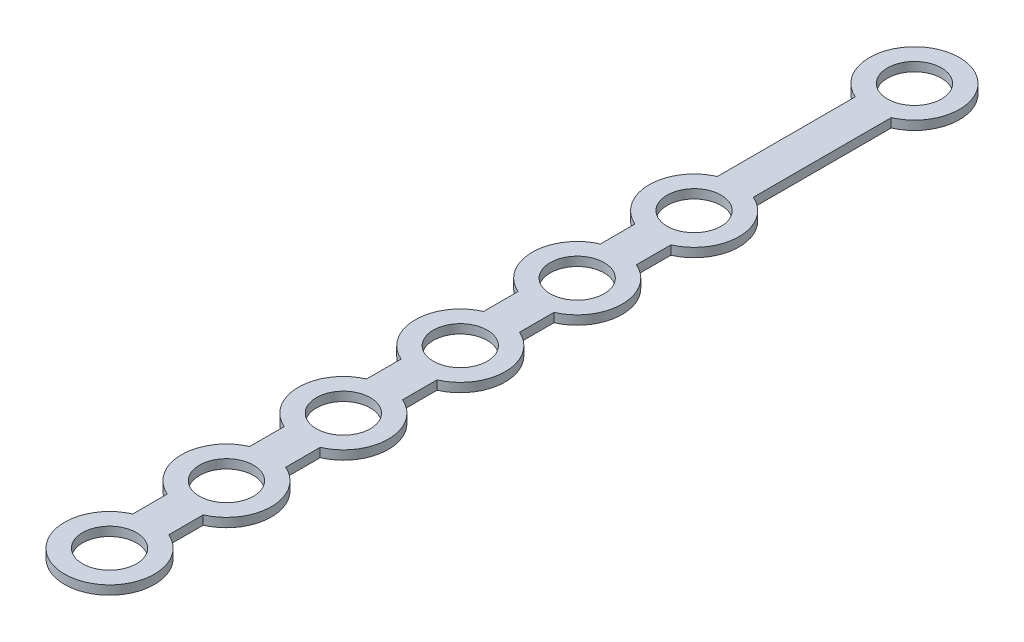
ISO-10303-21;
HEADER;
FILE_DESCRIPTION(('STEP AP214'),'2;1');
FILE_NAME('part.step','',(''),(''),'','','');
FILE_SCHEMA(('AUTOMOTIVE_DESIGN { 1 0 10303 214 1 1 1 1 }'));
ENDSEC;
DATA;
#1=APPLICATION_CONTEXT('core data for automotive mechanical design processes');
#2=APPLICATION_PROTOCOL_DEFINITION('international standard','automotive_design',2000,#1);
#3=PRODUCT_CONTEXT('',#1,'mechanical');
#4=PRODUCT('Part','Part','',(#3));
#5=PRODUCT_RELATED_PRODUCT_CATEGORY('part','',(#4));
#6=PRODUCT_DEFINITION_FORMATION('','',#4);
#7=PRODUCT_DEFINITION_CONTEXT('part definition',#1,'design');
#8=PRODUCT_DEFINITION('design','',#6,#7);
#9=PRODUCT_DEFINITION_SHAPE('','',#8);
#10=(LENGTH_UNIT() NAMED_UNIT(*) SI_UNIT(.MILLI.,.METRE.));
#11=(NAMED_UNIT(*) PLANE_ANGLE_UNIT() SI_UNIT($,.RADIAN.));
#12=(NAMED_UNIT(*) SI_UNIT($,.STERADIAN.) SOLID_ANGLE_UNIT());
#13=UNCERTAINTY_MEASURE_WITH_UNIT(LENGTH_MEASURE(1.E-05),#10,'distance_accuracy_value','');
#14=(GEOMETRIC_REPRESENTATION_CONTEXT(3) GLOBAL_UNCERTAINTY_ASSIGNED_CONTEXT((#13)) GLOBAL_UNIT_ASSIGNED_CONTEXT((#10,
#11,#12)) REPRESENTATION_CONTEXT('',''));
#15=CARTESIAN_POINT('',(0.,0.,0.));
#16=DIRECTION('',(0.,0.,1.));
#17=DIRECTION('',(1.,0.,0.));
#18=AXIS2_PLACEMENT_3D('',#15,#16,#17);
#19=CARTESIAN_POINT('',(0.,-2.,-130.));
#20=DIRECTION('',(0.,1.,0.));
#21=DIRECTION('',(0.,0.,1.));
#22=AXIS2_PLACEMENT_3D('',#19,#20,#21);
#23=CYLINDRICAL_SURFACE('',#22,10.);
#24=DIRECTION('',(0.,1.,0.));
#25=VECTOR('',#24,1.);
#26=CARTESIAN_POINT('',(4.,-2.,-139.165151389912));
#27=LINE('',#26,#25);
#28=CARTESIAN_POINT('',(4.,-2.,-139.165151389912));
#29=VERTEX_POINT('',#28);
#30=CARTESIAN_POINT('',(4.,0.,-139.165151389912));
#31=VERTEX_POINT('',#30);
#32=EDGE_CURVE('E239',#29,#31,#27,.T.);
#33=ORIENTED_EDGE('',*,*,#32,.T.);
#34=CARTESIAN_POINT('',(0.,0.,-130.));
#35=DIRECTION('',(0.,1.,0.));
#36=DIRECTION('',(0.,0.,1.));
#37=AXIS2_PLACEMENT_3D('',#34,#35,#36);
#38=CIRCLE('',#37,10.);
#39=CARTESIAN_POINT('',(3.99999999999999,0.,-120.834848610088));
#40=VERTEX_POINT('',#39);
#41=EDGE_CURVE('E232',#40,#31,#38,.T.);
#42=ORIENTED_EDGE('',*,*,#41,.F.);
#43=DIRECTION('',(0.,1.,0.));
#44=VECTOR('',#43,1.);
#45=CARTESIAN_POINT('',(3.99999999999999,-2.,-120.834848610088));
#46=LINE('',#45,#44);
#47=CARTESIAN_POINT('',(3.99999999999999,-2.,-120.834848610088));
#48=VERTEX_POINT('',#47);
#49=EDGE_CURVE('E60',#40,#48,#46,.F.);
#50=ORIENTED_EDGE('',*,*,#49,.T.);
#51=CARTESIAN_POINT('',(0.,-2.,-130.));
#52=DIRECTION('',(0.,1.,0.));
#53=DIRECTION('',(0.,0.,1.));
#54=AXIS2_PLACEMENT_3D('',#51,#52,#53);
#55=CIRCLE('',#54,10.);
#56=EDGE_CURVE('E244',#48,#29,#55,.T.);
#57=ORIENTED_EDGE('',*,*,#56,.T.);
#58=EDGE_LOOP('',(#33,#42,#50,#57));
#59=FACE_BOUND('',#58,.T.);
#60=ADVANCED_FACE('F52',(#59),#23,.T.);
#61=CARTESIAN_POINT('',(0.,-2.,-104.));
#62=DIRECTION('',(0.,1.,0.));
#63=DIRECTION('',(0.,0.,1.));
#64=AXIS2_PLACEMENT_3D('',#61,#62,#63);
#65=CYLINDRICAL_SURFACE('',#64,10.);
#66=DIRECTION('',(0.,1.,0.));
#67=VECTOR('',#66,1.);
#68=CARTESIAN_POINT('',(4.,-2.,-113.165151389912));
#69=LINE('',#68,#67);
#70=CARTESIAN_POINT('',(4.,-2.,-113.165151389912));
#71=VERTEX_POINT('',#70);
#72=CARTESIAN_POINT('',(4.,0.,-113.165151389912));
#73=VERTEX_POINT('',#72);
#74=EDGE_CURVE('E261',#71,#73,#69,.T.);
#75=ORIENTED_EDGE('',*,*,#74,.T.);
#76=CARTESIAN_POINT('',(0.,0.,-104.));
#77=DIRECTION('',(0.,1.,0.));
#78=DIRECTION('',(0.,0.,1.));
#79=AXIS2_PLACEMENT_3D('',#76,#77,#78);
#80=CIRCLE('',#79,10.);
#81=CARTESIAN_POINT('',(3.99999999999999,0.,-94.8348486100883));
#82=VERTEX_POINT('',#81);
#83=EDGE_CURVE('E271',#82,#73,#80,.T.);
#84=ORIENTED_EDGE('',*,*,#83,.F.);
#85=DIRECTION('',(0.,1.,0.));
#86=VECTOR('',#85,1.);
#87=CARTESIAN_POINT('',(3.99999999999999,-2.,-94.8348486100883));
#88=LINE('',#87,#86);
#89=CARTESIAN_POINT('',(3.99999999999999,-2.,-94.8348486100883));
#90=VERTEX_POINT('',#89);
#91=EDGE_CURVE('E398',#82,#90,#88,.F.);
#92=ORIENTED_EDGE('',*,*,#91,.T.);
#93=CARTESIAN_POINT('',(0.,-2.,-104.));
#94=DIRECTION('',(0.,1.,0.));
#95=DIRECTION('',(0.,0.,1.));
#96=AXIS2_PLACEMENT_3D('',#93,#94,#95);
#97=CIRCLE('',#96,10.);
#98=EDGE_CURVE('E266',#90,#71,#97,.T.);
#99=ORIENTED_EDGE('',*,*,#98,.T.);
#100=EDGE_LOOP('',(#75,#84,#92,#99));
#101=FACE_BOUND('',#100,.T.);
#102=ADVANCED_FACE('F411',(#101),#65,.T.);
#103=CARTESIAN_POINT('',(0.,-2.,-78.));
#104=DIRECTION('',(0.,1.,0.));
#105=DIRECTION('',(0.,0.,1.));
#106=AXIS2_PLACEMENT_3D('',#103,#104,#105);
#107=CYLINDRICAL_SURFACE('',#106,10.);
#108=DIRECTION('',(0.,1.,0.));
#109=VECTOR('',#108,1.);
#110=CARTESIAN_POINT('',(4.,-2.,-87.1651513899117));
#111=LINE('',#110,#109);
#112=CARTESIAN_POINT('',(4.,-2.,-87.1651513899117));
#113=VERTEX_POINT('',#112);
#114=CARTESIAN_POINT('',(4.,0.,-87.1651513899117));
#115=VERTEX_POINT('',#114);
#116=EDGE_CURVE('E287',#113,#115,#111,.T.);
#117=ORIENTED_EDGE('',*,*,#116,.T.);
#118=CARTESIAN_POINT('',(0.,0.,-78.));
#119=DIRECTION('',(0.,1.,0.));
#120=DIRECTION('',(0.,0.,1.));
#121=AXIS2_PLACEMENT_3D('',#118,#119,#120);
#122=CIRCLE('',#121,10.);
#123=CARTESIAN_POINT('',(3.99999999999999,0.,-68.8348486100883));
#124=VERTEX_POINT('',#123);
#125=EDGE_CURVE('E298',#124,#115,#122,.T.);
#126=ORIENTED_EDGE('',*,*,#125,.F.);
#127=DIRECTION('',(0.,1.,0.));
#128=VECTOR('',#127,1.);
#129=CARTESIAN_POINT('',(3.99999999999999,-2.,-68.8348486100883));
#130=LINE('',#129,#128);
#131=CARTESIAN_POINT('',(3.99999999999999,-2.,-68.8348486100883));
#132=VERTEX_POINT('',#131);
#133=EDGE_CURVE('E396',#124,#132,#130,.F.);
#134=ORIENTED_EDGE('',*,*,#133,.T.);
#135=CARTESIAN_POINT('',(0.,-2.,-78.));
#136=DIRECTION('',(0.,1.,0.));
#137=DIRECTION('',(0.,0.,1.));
#138=AXIS2_PLACEMENT_3D('',#135,#136,#137);
#139=CIRCLE('',#138,10.);
#140=EDGE_CURVE('E293',#132,#113,#139,.T.);
#141=ORIENTED_EDGE('',*,*,#140,.T.);
#142=EDGE_LOOP('',(#117,#126,#134,#141));
#143=FACE_BOUND('',#142,.T.);
#144=ADVANCED_FACE('F417',(#143),#107,.T.);
#145=CARTESIAN_POINT('',(0.,-2.,-52.));
#146=DIRECTION('',(0.,1.,0.));
#147=DIRECTION('',(0.,0.,1.));
#148=AXIS2_PLACEMENT_3D('',#145,#146,#147);
#149=CYLINDRICAL_SURFACE('',#148,10.);
#150=DIRECTION('',(0.,1.,0.));
#151=VECTOR('',#150,1.);
#152=CARTESIAN_POINT('',(-4.,-2.,-61.1651513899117));
#153=LINE('',#152,#151);
#154=CARTESIAN_POINT('',(-4.,-2.,-61.1651513899117));
#155=VERTEX_POINT('',#154);
#156=CARTESIAN_POINT('',(-4.,0.,-61.1651513899117));
#157=VERTEX_POINT('',#156);
#158=EDGE_CURVE('E314',#155,#157,#153,.T.);
#159=ORIENTED_EDGE('',*,*,#158,.F.);
#160=CARTESIAN_POINT('',(0.,-2.,-52.));
#161=DIRECTION('',(0.,1.,0.));
#162=DIRECTION('',(0.,0.,1.));
#163=AXIS2_PLACEMENT_3D('',#160,#161,#162);
#164=CIRCLE('',#163,10.);
#165=CARTESIAN_POINT('',(-4.,-2.,-42.8348486100883));
#166=VERTEX_POINT('',#165);
#167=EDGE_CURVE('E324',#155,#166,#164,.T.);
#168=ORIENTED_EDGE('',*,*,#167,.T.);
#169=DIRECTION('',(0.,1.,0.));
#170=VECTOR('',#169,1.);
#171=CARTESIAN_POINT('',(-4.,-2.,-42.8348486100883));
#172=LINE('',#171,#170);
#173=CARTESIAN_POINT('',(-4.,0.,-42.8348486100883));
#174=VERTEX_POINT('',#173);
#175=EDGE_CURVE('E391',#166,#174,#172,.T.);
#176=ORIENTED_EDGE('',*,*,#175,.T.);
#177=CARTESIAN_POINT('',(0.,0.,-52.));
#178=DIRECTION('',(0.,1.,0.));
#179=DIRECTION('',(0.,0.,1.));
#180=AXIS2_PLACEMENT_3D('',#177,#178,#179);
#181=CIRCLE('',#180,10.);
#182=EDGE_CURVE('E317',#157,#174,#181,.T.);
#183=ORIENTED_EDGE('',*,*,#182,.F.);
#184=EDGE_LOOP('',(#159,#168,#176,#183));
#185=FACE_BOUND('',#184,.T.);
#186=ADVANCED_FACE('F460',(#185),#149,.T.);
#187=CARTESIAN_POINT('',(0.,-2.,-26.));
#188=DIRECTION('',(0.,1.,0.));
#189=DIRECTION('',(0.,0.,1.));
#190=AXIS2_PLACEMENT_3D('',#187,#188,#189);
#191=CYLINDRICAL_SURFACE('',#190,10.);
#192=DIRECTION('',(0.,1.,0.));
#193=VECTOR('',#192,1.);
#194=CARTESIAN_POINT('',(4.,-2.,-35.1651513899117));
#195=LINE('',#194,#193);
#196=CARTESIAN_POINT('',(4.,-2.,-35.1651513899117));
#197=VERTEX_POINT('',#196);
#198=CARTESIAN_POINT('',(4.,0.,-35.1651513899117));
#199=VERTEX_POINT('',#198);
#200=EDGE_CURVE('E340',#197,#199,#195,.T.);
#201=ORIENTED_EDGE('',*,*,#200,.T.);
#202=CARTESIAN_POINT('',(0.,0.,-26.));
#203=DIRECTION('',(0.,1.,0.));
#204=DIRECTION('',(0.,0.,1.));
#205=AXIS2_PLACEMENT_3D('',#202,#203,#204);
#206=CIRCLE('',#205,10.);
#207=CARTESIAN_POINT('',(3.99999999999999,0.,-16.8348486100883));
#208=VERTEX_POINT('',#207);
#209=EDGE_CURVE('E357',#208,#199,#206,.T.);
#210=ORIENTED_EDGE('',*,*,#209,.F.);
#211=DIRECTION('',(0.,1.,0.));
#212=VECTOR('',#211,1.);
#213=CARTESIAN_POINT('',(4.,-2.,-16.8348486100883));
#214=LINE('',#213,#212);
#215=CARTESIAN_POINT('',(3.99999999999999,-2.,-16.8348486100883));
#216=VERTEX_POINT('',#215);
#217=EDGE_CURVE('E355',#216,#208,#214,.T.);
#218=ORIENTED_EDGE('',*,*,#217,.F.);
#219=CARTESIAN_POINT('',(0.,-2.,-26.));
#220=DIRECTION('',(0.,1.,0.));
#221=DIRECTION('',(0.,0.,1.));
#222=AXIS2_PLACEMENT_3D('',#219,#220,#221);
#223=CIRCLE('',#222,10.);
#224=EDGE_CURVE('E352',#216,#197,#223,.T.);
#225=ORIENTED_EDGE('',*,*,#224,.T.);
#226=EDGE_LOOP('',(#201,#210,#218,#225));
#227=FACE_BOUND('',#226,.T.);
#228=ADVANCED_FACE('F431',(#227),#191,.T.);
#229=CARTESIAN_POINT('',(0.,-2.,0.));
#230=DIRECTION('',(0.,1.,0.));
#231=DIRECTION('',(0.,0.,1.));
#232=AXIS2_PLACEMENT_3D('',#229,#230,#231);
#233=CYLINDRICAL_SURFACE('',#232,10.);
#234=DIRECTION('',(0.,1.,0.));
#235=VECTOR('',#234,1.);
#236=CARTESIAN_POINT('',(4.,-2.,-9.16515138991168));
#237=LINE('',#236,#235);
#238=CARTESIAN_POINT('',(4.,-2.,-9.16515138991168));
#239=VERTEX_POINT('',#238);
#240=CARTESIAN_POINT('',(4.,0.,-9.16515138991168));
#241=VERTEX_POINT('',#240);
#242=EDGE_CURVE('E376',#239,#241,#237,.T.);
#243=ORIENTED_EDGE('',*,*,#242,.T.);
#244=CARTESIAN_POINT('',(0.,0.,0.));
#245=DIRECTION('',(0.,1.,0.));
#246=DIRECTION('',(0.,0.,1.));
#247=AXIS2_PLACEMENT_3D('',#244,#245,#246);
#248=CIRCLE('',#247,10.);
#249=CARTESIAN_POINT('',(-4.,0.,-9.16515138991168));
#250=VERTEX_POINT('',#249);
#251=EDGE_CURVE('E385',#250,#241,#248,.T.);
#252=ORIENTED_EDGE('',*,*,#251,.F.);
#253=DIRECTION('',(0.,1.,0.));
#254=VECTOR('',#253,1.);
#255=CARTESIAN_POINT('',(-4.,-2.,-9.16515138991168));
#256=LINE('',#255,#254);
#257=CARTESIAN_POINT('',(-4.,-2.,-9.16515138991168));
#258=VERTEX_POINT('',#257);
#259=EDGE_CURVE('E372',#258,#250,#256,.T.);
#260=ORIENTED_EDGE('',*,*,#259,.F.);
#261=CARTESIAN_POINT('',(0.,-2.,0.));
#262=DIRECTION('',(0.,1.,0.));
#263=DIRECTION('',(0.,0.,1.));
#264=AXIS2_PLACEMENT_3D('',#261,#262,#263);
#265=CIRCLE('',#264,10.);
#266=EDGE_CURVE('E388',#258,#239,#265,.T.);
#267=ORIENTED_EDGE('',*,*,#266,.T.);
#268=EDGE_LOOP('',(#243,#252,#260,#267));
#269=FACE_BOUND('',#268,.T.);
#270=ADVANCED_FACE('F54',(#269),#233,.T.);
#271=CARTESIAN_POINT('',(0.,-2.,0.));
#272=DIRECTION('',(0.,1.,0.));
#273=DIRECTION('',(0.,0.,1.));
#274=AXIS2_PLACEMENT_3D('',#271,#272,#273);
#275=PLANE('',#274);
#276=CARTESIAN_POINT('',(0.,-2.,-52.));
#277=DIRECTION('',(0.,1.,0.));
#278=DIRECTION('',(0.,0.,1.));
#279=AXIS2_PLACEMENT_3D('',#276,#277,#278);
#280=CIRCLE('',#279,6.);
#281=CARTESIAN_POINT('',(0.,-2.,-46.));
#282=VERTEX_POINT('',#281);
#283=EDGE_CURVE('E218',#282,#282,#280,.T.);
#284=ORIENTED_EDGE('',*,*,#283,.T.);
#285=EDGE_LOOP('',(#284));
#286=FACE_BOUND('',#285,.T.);
#287=CARTESIAN_POINT('',(0.,-2.,-78.));
#288=DIRECTION('',(0.,1.,0.));
#289=DIRECTION('',(0.,0.,1.));
#290=AXIS2_PLACEMENT_3D('',#287,#288,#289);
#291=CIRCLE('',#290,6.);
#292=CARTESIAN_POINT('',(0.,-2.,-72.));
#293=VERTEX_POINT('',#292);
#294=EDGE_CURVE('E514',#293,#293,#291,.T.);
#295=ORIENTED_EDGE('',*,*,#294,.T.);
#296=EDGE_LOOP('',(#295));
#297=FACE_BOUND('',#296,.T.);
#298=CARTESIAN_POINT('',(0.,-2.,-104.));
#299=DIRECTION('',(0.,1.,0.));
#300=DIRECTION('',(0.,0.,1.));
#301=AXIS2_PLACEMENT_3D('',#298,#299,#300);
#302=CIRCLE('',#301,6.);
#303=CARTESIAN_POINT('',(0.,-2.,-98.));
#304=VERTEX_POINT('',#303);
#305=EDGE_CURVE('E508',#304,#304,#302,.T.);
#306=ORIENTED_EDGE('',*,*,#305,.T.);
#307=EDGE_LOOP('',(#306));
#308=FACE_BOUND('',#307,.T.);
#309=CARTESIAN_POINT('',(0.,-2.,-130.));
#310=DIRECTION('',(0.,1.,0.));
#311=DIRECTION('',(0.,0.,1.));
#312=AXIS2_PLACEMENT_3D('',#309,#310,#311);
#313=CIRCLE('',#312,6.);
#314=CARTESIAN_POINT('',(0.,-2.,-124.));
#315=VERTEX_POINT('',#314);
#316=EDGE_CURVE('E502',#315,#315,#313,.T.);
#317=ORIENTED_EDGE('',*,*,#316,.T.);
#318=EDGE_LOOP('',(#317));
#319=FACE_BOUND('',#318,.T.);
#320=CARTESIAN_POINT('',(0.,-2.,-179.));
#321=DIRECTION('',(0.,1.,0.));
#322=DIRECTION('',(0.,0.,1.));
#323=AXIS2_PLACEMENT_3D('',#320,#321,#322);
#324=CIRCLE('',#323,6.00000000000001);
#325=CARTESIAN_POINT('',(0.,-2.,-173.));
#326=VERTEX_POINT('',#325);
#327=EDGE_CURVE('E496',#326,#326,#324,.T.);
#328=ORIENTED_EDGE('',*,*,#327,.T.);
#329=EDGE_LOOP('',(#328));
#330=FACE_BOUND('',#329,.T.);
#331=CARTESIAN_POINT('',(0.,-2.,0.));
#332=DIRECTION('',(0.,1.,0.));
#333=DIRECTION('',(0.,0.,1.));
#334=AXIS2_PLACEMENT_3D('',#331,#332,#333);
#335=CIRCLE('',#334,6.);
#336=CARTESIAN_POINT('',(0.,-2.,6.));
#337=VERTEX_POINT('',#336);
#338=EDGE_CURVE('E382',#337,#337,#335,.T.);
#339=ORIENTED_EDGE('',*,*,#338,.T.);
#340=EDGE_LOOP('',(#339));
#341=FACE_BOUND('',#340,.T.);
#342=DIRECTION('',(0.,0.,1.));
#343=VECTOR('',#342,1.);
#344=CARTESIAN_POINT('',(-4.,-2.,-169.043915681042));
#345=LINE('',#344,#343);
#346=CARTESIAN_POINT('',(-4.,-2.,-169.834848610088));
#347=VERTEX_POINT('',#346);
#348=CARTESIAN_POINT('',(-4.,-2.,-139.165151389912));
#349=VERTEX_POINT('',#348);
#350=EDGE_CURVE('E234',#347,#349,#345,.T.);
#351=ORIENTED_EDGE('',*,*,#350,.F.);
#352=CARTESIAN_POINT('',(0.,-2.,-179.));
#353=DIRECTION('',(0.,1.,0.));
#354=DIRECTION('',(0.,0.,1.));
#355=AXIS2_PLACEMENT_3D('',#352,#353,#354);
#356=CIRCLE('',#355,10.);
#357=CARTESIAN_POINT('',(4.,-2.,-169.834848610088));
#358=VERTEX_POINT('',#357);
#359=EDGE_CURVE('E217',#358,#347,#356,.T.);
#360=ORIENTED_EDGE('',*,*,#359,.F.);
#361=DIRECTION('',(0.,0.,-1.));
#362=VECTOR('',#361,1.);
#363=CARTESIAN_POINT('',(4.,-2.,-160.165151389912));
#364=LINE('',#363,#362);
#365=EDGE_CURVE('E226',#29,#358,#364,.T.);
#366=ORIENTED_EDGE('',*,*,#365,.F.);
#367=ORIENTED_EDGE('',*,*,#56,.F.);
#368=DIRECTION('',(0.,0.,-1.));
#369=VECTOR('',#368,1.);
#370=CARTESIAN_POINT('',(4.,-2.,-113.165151389912));
#371=LINE('',#370,#369);
#372=EDGE_CURVE('E254',#71,#48,#371,.T.);
#373=ORIENTED_EDGE('',*,*,#372,.F.);
#374=ORIENTED_EDGE('',*,*,#98,.F.);
#375=DIRECTION('',(0.,0.,-1.));
#376=VECTOR('',#375,1.);
#377=CARTESIAN_POINT('',(4.,-2.,-87.1651513899117));
#378=LINE('',#377,#376);
#379=EDGE_CURVE('E279',#113,#90,#378,.T.);
#380=ORIENTED_EDGE('',*,*,#379,.F.);
#381=ORIENTED_EDGE('',*,*,#140,.F.);
#382=DIRECTION('',(0.,0.,-1.));
#383=VECTOR('',#382,1.);
#384=CARTESIAN_POINT('',(4.,-2.,-61.1651513899117));
#385=LINE('',#384,#383);
#386=CARTESIAN_POINT('',(4.,-2.,-61.1651513899117));
#387=VERTEX_POINT('',#386);
#388=EDGE_CURVE('E304',#387,#132,#385,.T.);
#389=ORIENTED_EDGE('',*,*,#388,.F.);
#390=CARTESIAN_POINT('',(3.99999999999999,-2.,-42.8348486100883));
#391=VERTEX_POINT('',#390);
#392=EDGE_CURVE('E320',#391,#387,#164,.T.);
#393=ORIENTED_EDGE('',*,*,#392,.F.);
#394=DIRECTION('',(0.,0.,-1.));
#395=VECTOR('',#394,1.);
#396=CARTESIAN_POINT('',(4.,-2.,-35.1651513899117));
#397=LINE('',#396,#395);
#398=EDGE_CURVE('E330',#197,#391,#397,.T.);
#399=ORIENTED_EDGE('',*,*,#398,.F.);
#400=ORIENTED_EDGE('',*,*,#224,.F.);
#401=DIRECTION('',(0.,0.,-1.));
#402=VECTOR('',#401,1.);
#403=CARTESIAN_POINT('',(4.,-2.,-13.));
#404=LINE('',#403,#402);
#405=EDGE_CURVE('E368',#239,#216,#404,.T.);
#406=ORIENTED_EDGE('',*,*,#405,.F.);
#407=ORIENTED_EDGE('',*,*,#266,.F.);
#408=DIRECTION('',(0.,0.,1.));
#409=VECTOR('',#408,1.);
#410=CARTESIAN_POINT('',(-4.,-2.,-13.));
#411=LINE('',#410,#409);
#412=CARTESIAN_POINT('',(-3.99999999999999,-2.,-16.8348486100883));
#413=VERTEX_POINT('',#412);
#414=EDGE_CURVE('E366',#413,#258,#411,.T.);
#415=ORIENTED_EDGE('',*,*,#414,.F.);
#416=CARTESIAN_POINT('',(-4.,-2.,-35.1651513899117));
#417=VERTEX_POINT('',#416);
#418=EDGE_CURVE('E356',#417,#413,#223,.T.);
#419=ORIENTED_EDGE('',*,*,#418,.F.);
#420=DIRECTION('',(0.,0.,1.));
#421=VECTOR('',#420,1.);
#422=CARTESIAN_POINT('',(-4.,-2.,-35.1651513899117));
#423=LINE('',#422,#421);
#424=EDGE_CURVE('E333',#166,#417,#423,.T.);
#425=ORIENTED_EDGE('',*,*,#424,.F.);
#426=ORIENTED_EDGE('',*,*,#167,.F.);
#427=DIRECTION('',(0.,0.,1.));
#428=VECTOR('',#427,1.);
#429=CARTESIAN_POINT('',(-4.,-2.,-61.1651513899117));
#430=LINE('',#429,#428);
#431=CARTESIAN_POINT('',(-4.,-2.,-68.8348486100883));
#432=VERTEX_POINT('',#431);
#433=EDGE_CURVE('E307',#432,#155,#430,.T.);
#434=ORIENTED_EDGE('',*,*,#433,.F.);
#435=CARTESIAN_POINT('',(-4.,-2.,-87.1651513899117));
#436=VERTEX_POINT('',#435);
#437=EDGE_CURVE('E297',#436,#432,#139,.T.);
#438=ORIENTED_EDGE('',*,*,#437,.F.);
#439=DIRECTION('',(0.,0.,1.));
#440=VECTOR('',#439,1.);
#441=CARTESIAN_POINT('',(-4.,-2.,-87.1651513899117));
#442=LINE('',#441,#440);
#443=CARTESIAN_POINT('',(-4.,-2.,-94.8348486100883));
#444=VERTEX_POINT('',#443);
#445=EDGE_CURVE('E277',#444,#436,#442,.T.);
#446=ORIENTED_EDGE('',*,*,#445,.F.);
#447=CARTESIAN_POINT('',(-4.,-2.,-113.165151389912));
#448=VERTEX_POINT('',#447);
#449=EDGE_CURVE('E270',#448,#444,#97,.T.);
#450=ORIENTED_EDGE('',*,*,#449,.F.);
#451=DIRECTION('',(0.,0.,1.));
#452=VECTOR('',#451,1.);
#453=CARTESIAN_POINT('',(-4.,-2.,-113.165151389912));
#454=LINE('',#453,#452);
#455=CARTESIAN_POINT('',(-4.,-2.,-120.834848610088));
#456=VERTEX_POINT('',#455);
#457=EDGE_CURVE('E252',#456,#448,#454,.T.);
#458=ORIENTED_EDGE('',*,*,#457,.F.);
#459=EDGE_CURVE('E248',#349,#456,#55,.T.);
#460=ORIENTED_EDGE('',*,*,#459,.F.);
#461=EDGE_LOOP('',(#351,#360,#366,#367,#373,#374,#380,#381,#389,#393,#399,#400,#406,#407,#415,
#419,#425,#426,#434,#438,#446,#450,#458,#460));
#462=FACE_BOUND('',#461,.T.);
#463=CARTESIAN_POINT('',(0.,-2.,-26.));
#464=DIRECTION('',(0.,1.,0.));
#465=DIRECTION('',(0.,0.,1.));
#466=AXIS2_PLACEMENT_3D('',#463,#464,#465);
#467=CIRCLE('',#466,6.);
#468=CARTESIAN_POINT('',(0.,-2.,-20.));
#469=VERTEX_POINT('',#468);
#470=EDGE_CURVE('E346',#469,#469,#467,.T.);
#471=ORIENTED_EDGE('',*,*,#470,.T.);
#472=EDGE_LOOP('',(#471));
#473=FACE_BOUND('',#472,.T.);
#474=ADVANCED_FACE('F406',(#286,#297,#308,#319,#330,#341,#462,#473),#275,.F.);
#475=CARTESIAN_POINT('',(0.,0.,0.));
#476=DIRECTION('',(0.,1.,0.));
#477=DIRECTION('',(0.,0.,1.));
#478=AXIS2_PLACEMENT_3D('',#475,#476,#477);
#479=PLANE('',#478);
#480=CARTESIAN_POINT('',(0.,0.,-52.));
#481=DIRECTION('',(0.,1.,0.));
#482=DIRECTION('',(0.,0.,1.));
#483=AXIS2_PLACEMENT_3D('',#480,#481,#482);
#484=CIRCLE('',#483,6.);
#485=CARTESIAN_POINT('',(0.,0.,-46.));
#486=VERTEX_POINT('',#485);
#487=EDGE_CURVE('E517',#486,#486,#484,.T.);
#488=ORIENTED_EDGE('',*,*,#487,.F.);
#489=EDGE_LOOP('',(#488));
#490=FACE_BOUND('',#489,.T.);
#491=CARTESIAN_POINT('',(0.,0.,-78.));
#492=DIRECTION('',(0.,1.,0.));
#493=DIRECTION('',(0.,0.,1.));
#494=AXIS2_PLACEMENT_3D('',#491,#492,#493);
#495=CIRCLE('',#494,6.);
#496=CARTESIAN_POINT('',(0.,0.,-72.));
#497=VERTEX_POINT('',#496);
#498=EDGE_CURVE('E511',#497,#497,#495,.T.);
#499=ORIENTED_EDGE('',*,*,#498,.F.);
#500=EDGE_LOOP('',(#499));
#501=FACE_BOUND('',#500,.T.);
#502=CARTESIAN_POINT('',(0.,0.,-104.));
#503=DIRECTION('',(0.,1.,0.));
#504=DIRECTION('',(0.,0.,1.));
#505=AXIS2_PLACEMENT_3D('',#502,#503,#504);
#506=CIRCLE('',#505,6.);
#507=CARTESIAN_POINT('',(0.,0.,-98.));
#508=VERTEX_POINT('',#507);
#509=EDGE_CURVE('E505',#508,#508,#506,.T.);
#510=ORIENTED_EDGE('',*,*,#509,.F.);
#511=EDGE_LOOP('',(#510));
#512=FACE_BOUND('',#511,.T.);
#513=CARTESIAN_POINT('',(0.,0.,-130.));
#514=DIRECTION('',(0.,1.,0.));
#515=DIRECTION('',(0.,0.,1.));
#516=AXIS2_PLACEMENT_3D('',#513,#514,#515);
#517=CIRCLE('',#516,6.);
#518=CARTESIAN_POINT('',(0.,0.,-124.));
#519=VERTEX_POINT('',#518);
#520=EDGE_CURVE('E499',#519,#519,#517,.T.);
#521=ORIENTED_EDGE('',*,*,#520,.F.);
#522=EDGE_LOOP('',(#521));
#523=FACE_BOUND('',#522,.T.);
#524=CARTESIAN_POINT('',(0.,0.,-179.));
#525=DIRECTION('',(0.,1.,0.));
#526=DIRECTION('',(0.,0.,1.));
#527=AXIS2_PLACEMENT_3D('',#524,#525,#526);
#528=CIRCLE('',#527,6.00000000000001);
#529=CARTESIAN_POINT('',(0.,0.,-173.));
#530=VERTEX_POINT('',#529);
#531=EDGE_CURVE('E493',#530,#530,#528,.T.);
#532=ORIENTED_EDGE('',*,*,#531,.F.);
#533=EDGE_LOOP('',(#532));
#534=FACE_BOUND('',#533,.T.);
#535=DIRECTION('',(0.,0.,-1.));
#536=VECTOR('',#535,1.);
#537=CARTESIAN_POINT('',(4.,0.,-160.165151389912));
#538=LINE('',#537,#536);
#539=CARTESIAN_POINT('',(4.,0.,-169.834848610088));
#540=VERTEX_POINT('',#539);
#541=EDGE_CURVE('E224',#31,#540,#538,.T.);
#542=ORIENTED_EDGE('',*,*,#541,.T.);
#543=CARTESIAN_POINT('',(0.,0.,-179.));
#544=DIRECTION('',(0.,1.,0.));
#545=DIRECTION('',(0.,0.,1.));
#546=AXIS2_PLACEMENT_3D('',#543,#544,#545);
#547=CIRCLE('',#546,10.);
#548=CARTESIAN_POINT('',(-4.,0.,-169.834848610088));
#549=VERTEX_POINT('',#548);
#550=EDGE_CURVE('E210',#540,#549,#547,.T.);
#551=ORIENTED_EDGE('',*,*,#550,.T.);
#552=DIRECTION('',(0.,0.,1.));
#553=VECTOR('',#552,1.);
#554=CARTESIAN_POINT('',(-4.,0.,-139.165151389912));
#555=LINE('',#554,#553);
#556=CARTESIAN_POINT('',(-3.99999999999998,0.,-139.165151389912));
#557=VERTEX_POINT('',#556);
#558=EDGE_CURVE('E67',#549,#557,#555,.T.);
#559=ORIENTED_EDGE('',*,*,#558,.T.);
#560=CARTESIAN_POINT('',(-4.,0.,-120.834848610088));
#561=VERTEX_POINT('',#560);
#562=EDGE_CURVE('E241',#557,#561,#38,.T.);
#563=ORIENTED_EDGE('',*,*,#562,.T.);
#564=DIRECTION('',(0.,0.,1.));
#565=VECTOR('',#564,1.);
#566=CARTESIAN_POINT('',(-4.,0.,-113.165151389912));
#567=LINE('',#566,#565);
#568=CARTESIAN_POINT('',(-3.99999999999996,0.,-113.165151389912));
#569=VERTEX_POINT('',#568);
#570=EDGE_CURVE('E73',#561,#569,#567,.T.);
#571=ORIENTED_EDGE('',*,*,#570,.T.);
#572=CARTESIAN_POINT('',(-4.,0.,-94.8348486100883));
#573=VERTEX_POINT('',#572);
#574=EDGE_CURVE('E264',#569,#573,#80,.T.);
#575=ORIENTED_EDGE('',*,*,#574,.T.);
#576=DIRECTION('',(0.,0.,1.));
#577=VECTOR('',#576,1.);
#578=CARTESIAN_POINT('',(-4.,0.,-87.1651513899117));
#579=LINE('',#578,#577);
#580=CARTESIAN_POINT('',(-3.99999999999999,0.,-87.1651513899117));
#581=VERTEX_POINT('',#580);
#582=EDGE_CURVE('E276',#573,#581,#579,.T.);
#583=ORIENTED_EDGE('',*,*,#582,.T.);
#584=CARTESIAN_POINT('',(-4.,0.,-68.8348486100883));
#585=VERTEX_POINT('',#584);
#586=EDGE_CURVE('E290',#581,#585,#122,.T.);
#587=ORIENTED_EDGE('',*,*,#586,.T.);
#588=DIRECTION('',(0.,0.,1.));
#589=VECTOR('',#588,1.);
#590=CARTESIAN_POINT('',(-4.,0.,-61.1651513899117));
#591=LINE('',#590,#589);
#592=EDGE_CURVE('E308',#585,#157,#591,.T.);
#593=ORIENTED_EDGE('',*,*,#592,.T.);
#594=ORIENTED_EDGE('',*,*,#182,.T.);
#595=DIRECTION('',(0.,0.,1.));
#596=VECTOR('',#595,1.);
#597=CARTESIAN_POINT('',(-4.,0.,-35.1651513899117));
#598=LINE('',#597,#596);
#599=CARTESIAN_POINT('',(-3.99999999999998,0.,-35.1651513899117));
#600=VERTEX_POINT('',#599);
#601=EDGE_CURVE('E334',#174,#600,#598,.T.);
#602=ORIENTED_EDGE('',*,*,#601,.T.);
#603=CARTESIAN_POINT('',(-4.,0.,-16.8348486100883));
#604=VERTEX_POINT('',#603);
#605=EDGE_CURVE('E349',#600,#604,#206,.T.);
#606=ORIENTED_EDGE('',*,*,#605,.T.);
#607=DIRECTION('',(0.,0.,1.));
#608=VECTOR('',#607,1.);
#609=CARTESIAN_POINT('',(-4.,0.,-13.));
#610=LINE('',#609,#608);
#611=EDGE_CURVE('E363',#604,#250,#610,.T.);
#612=ORIENTED_EDGE('',*,*,#611,.T.);
#613=ORIENTED_EDGE('',*,*,#251,.T.);
#614=DIRECTION('',(0.,0.,-1.));
#615=VECTOR('',#614,1.);
#616=CARTESIAN_POINT('',(4.,0.,-13.));
#617=LINE('',#616,#615);
#618=EDGE_CURVE('E369',#241,#208,#617,.T.);
#619=ORIENTED_EDGE('',*,*,#618,.T.);
#620=ORIENTED_EDGE('',*,*,#209,.T.);
#621=DIRECTION('',(0.,0.,-1.));
#622=VECTOR('',#621,1.);
#623=CARTESIAN_POINT('',(4.,0.,-35.1651513899117));
#624=LINE('',#623,#622);
#625=CARTESIAN_POINT('',(3.99999999999999,0.,-42.8348486100883));
#626=VERTEX_POINT('',#625);
#627=EDGE_CURVE('E329',#199,#626,#624,.T.);
#628=ORIENTED_EDGE('',*,*,#627,.T.);
#629=CARTESIAN_POINT('',(4.,0.,-61.1651513899117));
#630=VERTEX_POINT('',#629);
#631=EDGE_CURVE('E325',#626,#630,#181,.T.);
#632=ORIENTED_EDGE('',*,*,#631,.T.);
#633=DIRECTION('',(0.,0.,-1.));
#634=VECTOR('',#633,1.);
#635=CARTESIAN_POINT('',(4.,0.,-61.1651513899117));
#636=LINE('',#635,#634);
#637=EDGE_CURVE('E303',#630,#124,#636,.T.);
#638=ORIENTED_EDGE('',*,*,#637,.T.);
#639=ORIENTED_EDGE('',*,*,#125,.T.);
#640=DIRECTION('',(0.,0.,-1.));
#641=VECTOR('',#640,1.);
#642=CARTESIAN_POINT('',(4.,0.,-87.1651513899117));
#643=LINE('',#642,#641);
#644=EDGE_CURVE('E280',#115,#82,#643,.T.);
#645=ORIENTED_EDGE('',*,*,#644,.T.);
#646=ORIENTED_EDGE('',*,*,#83,.T.);
#647=DIRECTION('',(0.,0.,-1.));
#648=VECTOR('',#647,1.);
#649=CARTESIAN_POINT('',(4.,0.,-113.165151389912));
#650=LINE('',#649,#648);
#651=EDGE_CURVE('E255',#73,#40,#650,.T.);
#652=ORIENTED_EDGE('',*,*,#651,.T.);
#653=ORIENTED_EDGE('',*,*,#41,.T.);
#654=EDGE_LOOP('',(#542,#551,#559,#563,#571,#575,#583,#587,#593,#594,#602,#606,#612,#613,#619,
#620,#628,#632,#638,#639,#645,#646,#652,#653));
#655=FACE_BOUND('',#654,.T.);
#656=CARTESIAN_POINT('',(0.,0.,0.));
#657=DIRECTION('',(0.,1.,0.));
#658=DIRECTION('',(0.,0.,1.));
#659=AXIS2_PLACEMENT_3D('',#656,#657,#658);
#660=CIRCLE('',#659,6.);
#661=CARTESIAN_POINT('',(0.,0.,6.));
#662=VERTEX_POINT('',#661);
#663=EDGE_CURVE('E379',#662,#662,#660,.T.);
#664=ORIENTED_EDGE('',*,*,#663,.F.);
#665=EDGE_LOOP('',(#664));
#666=FACE_BOUND('',#665,.T.);
#667=CARTESIAN_POINT('',(0.,0.,-26.));
#668=DIRECTION('',(0.,1.,0.));
#669=DIRECTION('',(0.,0.,1.));
#670=AXIS2_PLACEMENT_3D('',#667,#668,#669);
#671=CIRCLE('',#670,6.);
#672=CARTESIAN_POINT('',(0.,0.,-20.));
#673=VERTEX_POINT('',#672);
#674=EDGE_CURVE('E343',#673,#673,#671,.T.);
#675=ORIENTED_EDGE('',*,*,#674,.F.);
#676=EDGE_LOOP('',(#675));
#677=FACE_BOUND('',#676,.T.);
#678=ADVANCED_FACE('F229',(#490,#501,#512,#523,#534,#655,#666,#677),#479,.T.);
#679=CARTESIAN_POINT('',(0.,-2.,0.));
#680=DIRECTION('',(0.,1.,0.));
#681=DIRECTION('',(0.,0.,1.));
#682=AXIS2_PLACEMENT_3D('',#679,#680,#681);
#683=CYLINDRICAL_SURFACE('',#682,6.);
#684=ORIENTED_EDGE('',*,*,#338,.F.);
#685=EDGE_LOOP('',(#684));
#686=FACE_BOUND('',#685,.T.);
#687=ORIENTED_EDGE('',*,*,#663,.T.);
#688=EDGE_LOOP('',(#687));
#689=FACE_BOUND('',#688,.T.);
#690=ADVANCED_FACE('F534',(#686,#689),#683,.F.);
#691=CARTESIAN_POINT('',(-4.,-2.,-13.));
#692=DIRECTION('',(-1.,0.,0.));
#693=DIRECTION('',(0.,0.,1.));
#694=AXIS2_PLACEMENT_3D('',#691,#692,#693);
#695=PLANE('',#694);
#696=ORIENTED_EDGE('',*,*,#611,.F.);
#697=DIRECTION('',(0.,1.,0.));
#698=VECTOR('',#697,1.);
#699=CARTESIAN_POINT('',(-4.,-2.,-16.8348486100883));
#700=LINE('',#699,#698);
#701=EDGE_CURVE('E360',#413,#604,#700,.T.);
#702=ORIENTED_EDGE('',*,*,#701,.F.);
#703=ORIENTED_EDGE('',*,*,#414,.T.);
#704=ORIENTED_EDGE('',*,*,#259,.T.);
#705=EDGE_LOOP('',(#696,#702,#703,#704));
#706=FACE_BOUND('',#705,.T.);
#707=ADVANCED_FACE('F444',(#706),#695,.T.);
#708=CARTESIAN_POINT('',(4.,-2.,-13.));
#709=DIRECTION('',(1.,0.,0.));
#710=DIRECTION('',(0.,0.,-1.));
#711=AXIS2_PLACEMENT_3D('',#708,#709,#710);
#712=PLANE('',#711);
#713=ORIENTED_EDGE('',*,*,#618,.F.);
#714=ORIENTED_EDGE('',*,*,#242,.F.);
#715=ORIENTED_EDGE('',*,*,#405,.T.);
#716=ORIENTED_EDGE('',*,*,#217,.T.);
#717=EDGE_LOOP('',(#713,#714,#715,#716));
#718=FACE_BOUND('',#717,.T.);
#719=ADVANCED_FACE('F436',(#718),#712,.T.);
#720=DIRECTION('',(0.,1.,0.));
#721=VECTOR('',#720,1.);
#722=CARTESIAN_POINT('',(-4.,-2.,-35.1651513899117));
#723=LINE('',#722,#721);
#724=EDGE_CURVE('E336',#417,#600,#723,.T.);
#725=ORIENTED_EDGE('',*,*,#724,.F.);
#726=ORIENTED_EDGE('',*,*,#418,.T.);
#727=ORIENTED_EDGE('',*,*,#701,.T.);
#728=ORIENTED_EDGE('',*,*,#605,.F.);
#729=EDGE_LOOP('',(#725,#726,#727,#728));
#730=FACE_BOUND('',#729,.T.);
#731=ADVANCED_FACE('F450',(#730),#191,.T.);
#732=CARTESIAN_POINT('',(0.,-2.,-26.));
#733=DIRECTION('',(0.,1.,0.));
#734=DIRECTION('',(0.,0.,1.));
#735=AXIS2_PLACEMENT_3D('',#732,#733,#734);
#736=CYLINDRICAL_SURFACE('',#735,6.);
#737=ORIENTED_EDGE('',*,*,#470,.F.);
#738=EDGE_LOOP('',(#737));
#739=FACE_BOUND('',#738,.T.);
#740=ORIENTED_EDGE('',*,*,#674,.T.);
#741=EDGE_LOOP('',(#740));
#742=FACE_BOUND('',#741,.T.);
#743=ADVANCED_FACE('F593',(#739,#742),#736,.F.);
#744=CARTESIAN_POINT('',(4.,-2.,-35.1651513899117));
#745=DIRECTION('',(1.,0.,0.));
#746=DIRECTION('',(0.,0.,-1.));
#747=AXIS2_PLACEMENT_3D('',#744,#745,#746);
#748=PLANE('',#747);
#749=DIRECTION('',(0.,1.,0.));
#750=VECTOR('',#749,1.);
#751=CARTESIAN_POINT('',(3.99999999999999,-2.,-42.8348486100883));
#752=LINE('',#751,#750);
#753=EDGE_CURVE('E323',#626,#391,#752,.F.);
#754=ORIENTED_EDGE('',*,*,#753,.F.);
#755=ORIENTED_EDGE('',*,*,#627,.F.);
#756=ORIENTED_EDGE('',*,*,#200,.F.);
#757=ORIENTED_EDGE('',*,*,#398,.T.);
#758=EDGE_LOOP('',(#754,#755,#756,#757));
#759=FACE_BOUND('',#758,.T.);
#760=ADVANCED_FACE('F428',(#759),#748,.T.);
#761=CARTESIAN_POINT('',(-4.,-2.,-35.1651513899117));
#762=DIRECTION('',(-1.,0.,0.));
#763=DIRECTION('',(0.,0.,1.));
#764=AXIS2_PLACEMENT_3D('',#761,#762,#763);
#765=PLANE('',#764);
#766=ORIENTED_EDGE('',*,*,#175,.F.);
#767=ORIENTED_EDGE('',*,*,#424,.T.);
#768=ORIENTED_EDGE('',*,*,#724,.T.);
#769=ORIENTED_EDGE('',*,*,#601,.F.);
#770=EDGE_LOOP('',(#766,#767,#768,#769));
#771=FACE_BOUND('',#770,.T.);
#772=ADVANCED_FACE('F454',(#771),#765,.T.);
#773=DIRECTION('',(0.,1.,0.));
#774=VECTOR('',#773,1.);
#775=CARTESIAN_POINT('',(4.,-2.,-61.1651513899117));
#776=LINE('',#775,#774);
#777=EDGE_CURVE('E310',#387,#630,#776,.T.);
#778=ORIENTED_EDGE('',*,*,#777,.T.);
#779=ORIENTED_EDGE('',*,*,#631,.F.);
#780=ORIENTED_EDGE('',*,*,#753,.T.);
#781=ORIENTED_EDGE('',*,*,#392,.T.);
#782=EDGE_LOOP('',(#778,#779,#780,#781));
#783=FACE_BOUND('',#782,.T.);
#784=ADVANCED_FACE('F425',(#783),#149,.T.);
#785=CARTESIAN_POINT('',(-4.,-2.,-61.1651513899117));
#786=DIRECTION('',(-1.,0.,0.));
#787=DIRECTION('',(0.,0.,1.));
#788=AXIS2_PLACEMENT_3D('',#785,#786,#787);
#789=PLANE('',#788);
#790=DIRECTION('',(0.,1.,0.));
#791=VECTOR('',#790,1.);
#792=CARTESIAN_POINT('',(-4.,-2.,-68.8348486100883));
#793=LINE('',#792,#791);
#794=EDGE_CURVE('E296',#432,#585,#793,.T.);
#795=ORIENTED_EDGE('',*,*,#794,.F.);
#796=ORIENTED_EDGE('',*,*,#433,.T.);
#797=ORIENTED_EDGE('',*,*,#158,.T.);
#798=ORIENTED_EDGE('',*,*,#592,.F.);
#799=EDGE_LOOP('',(#795,#796,#797,#798));
#800=FACE_BOUND('',#799,.T.);
#801=ADVANCED_FACE('F465',(#800),#789,.T.);
#802=CARTESIAN_POINT('',(4.,-2.,-61.1651513899117));
#803=DIRECTION('',(1.,0.,0.));
#804=DIRECTION('',(0.,0.,-1.));
#805=AXIS2_PLACEMENT_3D('',#802,#803,#804);
#806=PLANE('',#805);
#807=ORIENTED_EDGE('',*,*,#133,.F.);
#808=ORIENTED_EDGE('',*,*,#637,.F.);
#809=ORIENTED_EDGE('',*,*,#777,.F.);
#810=ORIENTED_EDGE('',*,*,#388,.T.);
#811=EDGE_LOOP('',(#807,#808,#809,#810));
#812=FACE_BOUND('',#811,.T.);
#813=ADVANCED_FACE('F423',(#812),#806,.T.);
#814=DIRECTION('',(0.,1.,0.));
#815=VECTOR('',#814,1.);
#816=CARTESIAN_POINT('',(-4.,-2.,-87.1651513899117));
#817=LINE('',#816,#815);
#818=EDGE_CURVE('E283',#436,#581,#817,.T.);
#819=ORIENTED_EDGE('',*,*,#818,.F.);
#820=ORIENTED_EDGE('',*,*,#437,.T.);
#821=ORIENTED_EDGE('',*,*,#794,.T.);
#822=ORIENTED_EDGE('',*,*,#586,.F.);
#823=EDGE_LOOP('',(#819,#820,#821,#822));
#824=FACE_BOUND('',#823,.T.);
#825=ADVANCED_FACE('F469',(#824),#107,.T.);
#826=CARTESIAN_POINT('',(-4.,-2.,-87.1651513899117));
#827=DIRECTION('',(-1.,0.,0.));
#828=DIRECTION('',(0.,0.,1.));
#829=AXIS2_PLACEMENT_3D('',#826,#827,#828);
#830=PLANE('',#829);
#831=DIRECTION('',(0.,1.,0.));
#832=VECTOR('',#831,1.);
#833=CARTESIAN_POINT('',(-4.,-2.,-94.8348486100883));
#834=LINE('',#833,#832);
#835=EDGE_CURVE('E269',#444,#573,#834,.T.);
#836=ORIENTED_EDGE('',*,*,#835,.F.);
#837=ORIENTED_EDGE('',*,*,#445,.T.);
#838=ORIENTED_EDGE('',*,*,#818,.T.);
#839=ORIENTED_EDGE('',*,*,#582,.F.);
#840=EDGE_LOOP('',(#836,#837,#838,#839));
#841=FACE_BOUND('',#840,.T.);
#842=ADVANCED_FACE('F475',(#841),#830,.T.);
#843=CARTESIAN_POINT('',(4.,-2.,-87.1651513899117));
#844=DIRECTION('',(1.,0.,0.));
#845=DIRECTION('',(0.,0.,-1.));
#846=AXIS2_PLACEMENT_3D('',#843,#844,#845);
#847=PLANE('',#846);
#848=ORIENTED_EDGE('',*,*,#91,.F.);
#849=ORIENTED_EDGE('',*,*,#644,.F.);
#850=ORIENTED_EDGE('',*,*,#116,.F.);
#851=ORIENTED_EDGE('',*,*,#379,.T.);
#852=EDGE_LOOP('',(#848,#849,#850,#851));
#853=FACE_BOUND('',#852,.T.);
#854=ADVANCED_FACE('F414',(#853),#847,.T.);
#855=DIRECTION('',(0.,1.,0.));
#856=VECTOR('',#855,1.);
#857=CARTESIAN_POINT('',(-4.,-2.,-113.165151389912));
#858=LINE('',#857,#856);
#859=EDGE_CURVE('E258',#448,#569,#858,.T.);
#860=ORIENTED_EDGE('',*,*,#859,.F.);
#861=ORIENTED_EDGE('',*,*,#449,.T.);
#862=ORIENTED_EDGE('',*,*,#835,.T.);
#863=ORIENTED_EDGE('',*,*,#574,.F.);
#864=EDGE_LOOP('',(#860,#861,#862,#863));
#865=FACE_BOUND('',#864,.T.);
#866=ADVANCED_FACE('F480',(#865),#65,.T.);
#867=CARTESIAN_POINT('',(-4.,-2.,-113.165151389912));
#868=DIRECTION('',(-1.,0.,0.));
#869=DIRECTION('',(0.,0.,1.));
#870=AXIS2_PLACEMENT_3D('',#867,#868,#869);
#871=PLANE('',#870);
#872=DIRECTION('',(0.,1.,0.));
#873=VECTOR('',#872,1.);
#874=CARTESIAN_POINT('',(-4.,-2.,-120.834848610088));
#875=LINE('',#874,#873);
#876=EDGE_CURVE('E247',#456,#561,#875,.T.);
#877=ORIENTED_EDGE('',*,*,#876,.F.);
#878=ORIENTED_EDGE('',*,*,#457,.T.);
#879=ORIENTED_EDGE('',*,*,#859,.T.);
#880=ORIENTED_EDGE('',*,*,#570,.F.);
#881=EDGE_LOOP('',(#877,#878,#879,#880));
#882=FACE_BOUND('',#881,.T.);
#883=ADVANCED_FACE('F483',(#882),#871,.T.);
#884=CARTESIAN_POINT('',(4.,-2.,-113.165151389912));
#885=DIRECTION('',(1.,0.,0.));
#886=DIRECTION('',(0.,0.,-1.));
#887=AXIS2_PLACEMENT_3D('',#884,#885,#886);
#888=PLANE('',#887);
#889=ORIENTED_EDGE('',*,*,#49,.F.);
#890=ORIENTED_EDGE('',*,*,#651,.F.);
#891=ORIENTED_EDGE('',*,*,#74,.F.);
#892=ORIENTED_EDGE('',*,*,#372,.T.);
#893=EDGE_LOOP('',(#889,#890,#891,#892));
#894=FACE_BOUND('',#893,.T.);
#895=ADVANCED_FACE('F409',(#894),#888,.T.);
#896=DIRECTION('',(0.,1.,0.));
#897=VECTOR('',#896,1.);
#898=CARTESIAN_POINT('',(-4.,-2.,-139.165151389912));
#899=LINE('',#898,#897);
#900=EDGE_CURVE('E242',#349,#557,#899,.T.);
#901=ORIENTED_EDGE('',*,*,#900,.F.);
#902=ORIENTED_EDGE('',*,*,#459,.T.);
#903=ORIENTED_EDGE('',*,*,#876,.T.);
#904=ORIENTED_EDGE('',*,*,#562,.F.);
#905=EDGE_LOOP('',(#901,#902,#903,#904));
#906=FACE_BOUND('',#905,.T.);
#907=ADVANCED_FACE('F487',(#906),#23,.T.);
#908=CARTESIAN_POINT('',(4.,-2.,-160.165151389912));
#909=DIRECTION('',(1.,0.,0.));
#910=DIRECTION('',(0.,0.,-1.));
#911=AXIS2_PLACEMENT_3D('',#908,#909,#910);
#912=PLANE('',#911);
#913=DIRECTION('',(0.,1.,0.));
#914=VECTOR('',#913,1.);
#915=CARTESIAN_POINT('',(4.,-2.,-169.834848610088));
#916=LINE('',#915,#914);
#917=EDGE_CURVE('E213',#540,#358,#916,.F.);
#918=ORIENTED_EDGE('',*,*,#917,.F.);
#919=ORIENTED_EDGE('',*,*,#541,.F.);
#920=ORIENTED_EDGE('',*,*,#32,.F.);
#921=ORIENTED_EDGE('',*,*,#365,.T.);
#922=EDGE_LOOP('',(#918,#919,#920,#921));
#923=FACE_BOUND('',#922,.T.);
#924=ADVANCED_FACE('F222',(#923),#912,.T.);
#925=CARTESIAN_POINT('',(-4.,-2.,-139.165151389912));
#926=DIRECTION('',(-1.,0.,0.));
#927=DIRECTION('',(0.,0.,1.));
#928=AXIS2_PLACEMENT_3D('',#925,#926,#927);
#929=PLANE('',#928);
#930=DIRECTION('',(0.,1.,0.));
#931=VECTOR('',#930,1.);
#932=CARTESIAN_POINT('',(-4.,-2.,-169.834848610088));
#933=LINE('',#932,#931);
#934=EDGE_CURVE('E13',#347,#549,#933,.T.);
#935=ORIENTED_EDGE('',*,*,#934,.F.);
#936=ORIENTED_EDGE('',*,*,#350,.T.);
#937=ORIENTED_EDGE('',*,*,#900,.T.);
#938=ORIENTED_EDGE('',*,*,#558,.F.);
#939=EDGE_LOOP('',(#935,#936,#937,#938));
#940=FACE_BOUND('',#939,.T.);
#941=ADVANCED_FACE('F490',(#940),#929,.T.);
#942=CARTESIAN_POINT('',(0.,-2.,-179.));
#943=DIRECTION('',(0.,1.,0.));
#944=DIRECTION('',(0.,0.,1.));
#945=AXIS2_PLACEMENT_3D('',#942,#943,#944);
#946=CYLINDRICAL_SURFACE('',#945,10.);
#947=ORIENTED_EDGE('',*,*,#550,.F.);
#948=ORIENTED_EDGE('',*,*,#917,.T.);
#949=ORIENTED_EDGE('',*,*,#359,.T.);
#950=ORIENTED_EDGE('',*,*,#934,.T.);
#951=EDGE_LOOP('',(#947,#948,#949,#950));
#952=FACE_BOUND('',#951,.T.);
#953=ADVANCED_FACE('F212',(#952),#946,.T.);
#954=CARTESIAN_POINT('',(0.,-2.,-179.));
#955=DIRECTION('',(0.,1.,0.));
#956=DIRECTION('',(0.,0.,1.));
#957=AXIS2_PLACEMENT_3D('',#954,#955,#956);
#958=CYLINDRICAL_SURFACE('',#957,6.00000000000001);
#959=ORIENTED_EDGE('',*,*,#327,.F.);
#960=EDGE_LOOP('',(#959));
#961=FACE_BOUND('',#960,.T.);
#962=ORIENTED_EDGE('',*,*,#531,.T.);
#963=EDGE_LOOP('',(#962));
#964=FACE_BOUND('',#963,.T.);
#965=ADVANCED_FACE('F543',(#961,#964),#958,.F.);
#966=CARTESIAN_POINT('',(0.,-2.,-130.));
#967=DIRECTION('',(0.,1.,0.));
#968=DIRECTION('',(0.,0.,1.));
#969=AXIS2_PLACEMENT_3D('',#966,#967,#968);
#970=CYLINDRICAL_SURFACE('',#969,6.);
#971=ORIENTED_EDGE('',*,*,#316,.F.);
#972=EDGE_LOOP('',(#971));
#973=FACE_BOUND('',#972,.T.);
#974=ORIENTED_EDGE('',*,*,#520,.T.);
#975=EDGE_LOOP('',(#974));
#976=FACE_BOUND('',#975,.T.);
#977=ADVANCED_FACE('F545',(#973,#976),#970,.F.);
#978=CARTESIAN_POINT('',(0.,-2.,-104.));
#979=DIRECTION('',(0.,1.,0.));
#980=DIRECTION('',(0.,0.,1.));
#981=AXIS2_PLACEMENT_3D('',#978,#979,#980);
#982=CYLINDRICAL_SURFACE('',#981,6.);
#983=ORIENTED_EDGE('',*,*,#305,.F.);
#984=EDGE_LOOP('',(#983));
#985=FACE_BOUND('',#984,.T.);
#986=ORIENTED_EDGE('',*,*,#509,.T.);
#987=EDGE_LOOP('',(#986));
#988=FACE_BOUND('',#987,.T.);
#989=ADVANCED_FACE('F552',(#985,#988),#982,.F.);
#990=CARTESIAN_POINT('',(0.,-2.,-78.));
#991=DIRECTION('',(0.,1.,0.));
#992=DIRECTION('',(0.,0.,1.));
#993=AXIS2_PLACEMENT_3D('',#990,#991,#992);
#994=CYLINDRICAL_SURFACE('',#993,6.);
#995=ORIENTED_EDGE('',*,*,#294,.F.);
#996=EDGE_LOOP('',(#995));
#997=FACE_BOUND('',#996,.T.);
#998=ORIENTED_EDGE('',*,*,#498,.T.);
#999=EDGE_LOOP('',(#998));
#1000=FACE_BOUND('',#999,.T.);
#1001=ADVANCED_FACE('F528',(#997,#1000),#994,.F.);
#1002=CARTESIAN_POINT('',(0.,-2.,-52.));
#1003=DIRECTION('',(0.,1.,0.));
#1004=DIRECTION('',(0.,0.,1.));
#1005=AXIS2_PLACEMENT_3D('',#1002,#1003,#1004);
#1006=CYLINDRICAL_SURFACE('',#1005,6.);
#1007=ORIENTED_EDGE('',*,*,#283,.F.);
#1008=EDGE_LOOP('',(#1007));
#1009=FACE_BOUND('',#1008,.T.);
#1010=ORIENTED_EDGE('',*,*,#487,.T.);
#1011=EDGE_LOOP('',(#1010));
#1012=FACE_BOUND('',#1011,.T.);
#1013=ADVANCED_FACE('F525',(#1009,#1012),#1006,.F.);
#1014=CLOSED_SHELL('',(#60,#102,#144,#186,#228,#270,#474,#678,#690,#707,#719,#731,#743,#760,
#772,#784,#801,#813,#825,#842,#854,#866,#883,#895,#907,#924,#941,#953,#965,#977,#989,#1001,#1013));
#1015=MANIFOLD_SOLID_BREP('B2',#1014);
#1016=ADVANCED_BREP_SHAPE_REPRESENTATION('',(#18,#1015),#14);
#1017=SHAPE_DEFINITION_REPRESENTATION(#9,#1016);
ENDSEC;
END-ISO-10303-21;
